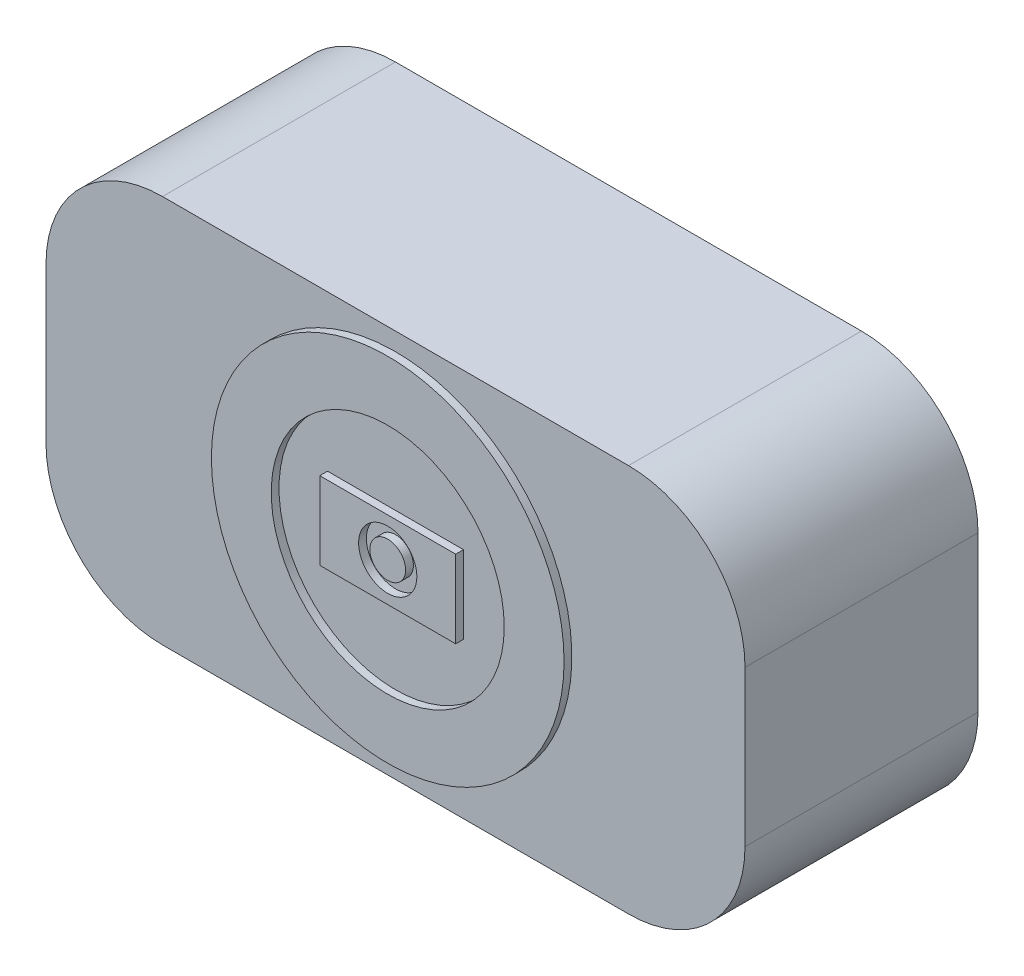
ISO-10303-21;
HEADER;
FILE_DESCRIPTION(('STEP AP214'),'2;1');
FILE_NAME('part.step','',(''),(''),'','','');
FILE_SCHEMA(('AUTOMOTIVE_DESIGN { 1 0 10303 214 1 1 1 1 }'));
ENDSEC;
DATA;
#1=APPLICATION_CONTEXT('core data for automotive mechanical design processes');
#2=APPLICATION_PROTOCOL_DEFINITION('international standard','automotive_design',2000,#1);
#3=PRODUCT_CONTEXT('',#1,'mechanical');
#4=PRODUCT('Part','Part','',(#3));
#5=PRODUCT_RELATED_PRODUCT_CATEGORY('part','',(#4));
#6=PRODUCT_DEFINITION_FORMATION('','',#4);
#7=PRODUCT_DEFINITION_CONTEXT('part definition',#1,'design');
#8=PRODUCT_DEFINITION('design','',#6,#7);
#9=PRODUCT_DEFINITION_SHAPE('','',#8);
#10=(LENGTH_UNIT() NAMED_UNIT(*) SI_UNIT(.MILLI.,.METRE.));
#11=(NAMED_UNIT(*) PLANE_ANGLE_UNIT() SI_UNIT($,.RADIAN.));
#12=(NAMED_UNIT(*) SI_UNIT($,.STERADIAN.) SOLID_ANGLE_UNIT());
#13=UNCERTAINTY_MEASURE_WITH_UNIT(LENGTH_MEASURE(1.E-05),#10,'distance_accuracy_value','');
#14=(GEOMETRIC_REPRESENTATION_CONTEXT(3) GLOBAL_UNCERTAINTY_ASSIGNED_CONTEXT((#13)) GLOBAL_UNIT_ASSIGNED_CONTEXT((#10,
#11,#12)) REPRESENTATION_CONTEXT('',''));
#15=CARTESIAN_POINT('',(0.,0.,0.));
#16=DIRECTION('',(0.,0.,1.));
#17=DIRECTION('',(1.,0.,0.));
#18=AXIS2_PLACEMENT_3D('',#15,#16,#17);
#19=CARTESIAN_POINT('',(45.,25.,0.));
#20=DIRECTION('',(0.,0.,1.));
#21=DIRECTION('',(1.,0.,0.));
#22=AXIS2_PLACEMENT_3D('',#19,#20,#21);
#23=PLANE('',#22);
#24=CARTESIAN_POINT('',(45.,25.,0.));
#25=DIRECTION('',(0.,0.,1.));
#26=DIRECTION('',(1.,0.,0.));
#27=AXIS2_PLACEMENT_3D('',#24,#25,#26);
#28=CIRCLE('',#27,3.75000000000001);
#29=CARTESIAN_POINT('',(48.75,25.,0.));
#30=VERTEX_POINT('',#29);
#31=EDGE_CURVE('E433',#30,#30,#28,.T.);
#32=ORIENTED_EDGE('',*,*,#31,.T.);
#33=EDGE_LOOP('',(#32));
#34=FACE_BOUND('',#33,.T.);
#35=CARTESIAN_POINT('',(45.,25.,0.));
#36=DIRECTION('',(0.,0.,1.));
#37=DIRECTION('',(1.,0.,0.));
#38=AXIS2_PLACEMENT_3D('',#35,#36,#37);
#39=CIRCLE('',#38,2.30333071039238);
#40=CARTESIAN_POINT('',(47.3033307103924,25.,0.));
#41=VERTEX_POINT('',#40);
#42=EDGE_CURVE('E430',#41,#41,#39,.T.);
#43=ORIENTED_EDGE('',*,*,#42,.F.);
#44=EDGE_LOOP('',(#43));
#45=FACE_BOUND('',#44,.T.);
#46=ADVANCED_FACE('F33',(#34,#45),#23,.T.);
#47=CARTESIAN_POINT('',(45.,25.,0.));
#48=DIRECTION('',(0.,0.,1.));
#49=DIRECTION('',(1.,0.,0.));
#50=AXIS2_PLACEMENT_3D('',#47,#48,#49);
#51=PLANE('',#50);
#52=CARTESIAN_POINT('',(45.,25.,0.));
#53=DIRECTION('',(0.,0.,1.));
#54=DIRECTION('',(1.,0.,0.));
#55=AXIS2_PLACEMENT_3D('',#52,#53,#54);
#56=CIRCLE('',#55,15.);
#57=CARTESIAN_POINT('',(60.,25.,0.));
#58=VERTEX_POINT('',#57);
#59=EDGE_CURVE('E152',#58,#58,#56,.T.);
#60=ORIENTED_EDGE('',*,*,#59,.T.);
#61=EDGE_LOOP('',(#60));
#62=FACE_BOUND('',#61,.T.);
#63=DIRECTION('',(1.,0.,0.));
#64=VECTOR('',#63,1.);
#65=CARTESIAN_POINT('',(36.25,20.,0.));
#66=LINE('',#65,#64);
#67=CARTESIAN_POINT('',(36.25,20.,0.));
#68=VERTEX_POINT('',#67);
#69=CARTESIAN_POINT('',(53.75,20.,0.));
#70=VERTEX_POINT('',#69);
#71=EDGE_CURVE('E443',#68,#70,#66,.T.);
#72=ORIENTED_EDGE('',*,*,#71,.F.);
#73=DIRECTION('',(0.,-1.,0.));
#74=VECTOR('',#73,1.);
#75=CARTESIAN_POINT('',(36.25,20.,0.));
#76=LINE('',#75,#74);
#77=CARTESIAN_POINT('',(36.25,30.,0.));
#78=VERTEX_POINT('',#77);
#79=EDGE_CURVE('E147',#78,#68,#76,.T.);
#80=ORIENTED_EDGE('',*,*,#79,.F.);
#81=DIRECTION('',(-1.,0.,0.));
#82=VECTOR('',#81,1.);
#83=CARTESIAN_POINT('',(36.25,30.,0.));
#84=LINE('',#83,#82);
#85=CARTESIAN_POINT('',(53.75,30.,0.));
#86=VERTEX_POINT('',#85);
#87=EDGE_CURVE('E143',#86,#78,#84,.T.);
#88=ORIENTED_EDGE('',*,*,#87,.F.);
#89=DIRECTION('',(0.,1.,0.));
#90=VECTOR('',#89,1.);
#91=CARTESIAN_POINT('',(53.75,20.,0.));
#92=LINE('',#91,#90);
#93=EDGE_CURVE('E445',#70,#86,#92,.T.);
#94=ORIENTED_EDGE('',*,*,#93,.F.);
#95=EDGE_LOOP('',(#72,#80,#88,#94));
#96=FACE_BOUND('',#95,.T.);
#97=ADVANCED_FACE('F261',(#62,#96),#51,.T.);
#98=CARTESIAN_POINT('',(0.,0.,0.));
#99=DIRECTION('',(0.,0.,-1.));
#100=DIRECTION('',(-1.,0.,0.));
#101=AXIS2_PLACEMENT_3D('',#98,#99,#100);
#102=PLANE('',#101);
#103=DIRECTION('',(1.,0.,0.));
#104=VECTOR('',#103,1.);
#105=CARTESIAN_POINT('',(0.,0.,0.));
#106=LINE('',#105,#104);
#107=CARTESIAN_POINT('',(15.,0.,0.));
#108=VERTEX_POINT('',#107);
#109=CARTESIAN_POINT('',(75.,0.,0.));
#110=VERTEX_POINT('',#109);
#111=EDGE_CURVE('E178',#108,#110,#106,.T.);
#112=ORIENTED_EDGE('',*,*,#111,.T.);
#113=CARTESIAN_POINT('',(75.,15.,0.));
#114=DIRECTION('',(0.,0.,-1.));
#115=DIRECTION('',(-1.,0.,0.));
#116=AXIS2_PLACEMENT_3D('',#113,#114,#115);
#117=CIRCLE('',#116,15.);
#118=CARTESIAN_POINT('',(90.,15.,0.));
#119=VERTEX_POINT('',#118);
#120=EDGE_CURVE('E196',#110,#119,#117,.F.);
#121=ORIENTED_EDGE('',*,*,#120,.T.);
#122=DIRECTION('',(0.,1.,0.));
#123=VECTOR('',#122,1.);
#124=CARTESIAN_POINT('',(90.,0.,0.));
#125=LINE('',#124,#123);
#126=CARTESIAN_POINT('',(90.,35.,0.));
#127=VERTEX_POINT('',#126);
#128=EDGE_CURVE('E181',#119,#127,#125,.T.);
#129=ORIENTED_EDGE('',*,*,#128,.T.);
#130=CARTESIAN_POINT('',(75.,35.,0.));
#131=DIRECTION('',(0.,0.,-1.));
#132=DIRECTION('',(-1.,0.,0.));
#133=AXIS2_PLACEMENT_3D('',#130,#131,#132);
#134=CIRCLE('',#133,15.);
#135=CARTESIAN_POINT('',(75.,50.,0.));
#136=VERTEX_POINT('',#135);
#137=EDGE_CURVE('E190',#127,#136,#134,.F.);
#138=ORIENTED_EDGE('',*,*,#137,.T.);
#139=DIRECTION('',(-1.,0.,0.));
#140=VECTOR('',#139,1.);
#141=CARTESIAN_POINT('',(0.,50.,0.));
#142=LINE('',#141,#140);
#143=CARTESIAN_POINT('',(15.,50.,0.));
#144=VERTEX_POINT('',#143);
#145=EDGE_CURVE('E167',#136,#144,#142,.T.);
#146=ORIENTED_EDGE('',*,*,#145,.T.);
#147=CARTESIAN_POINT('',(15.,35.,0.));
#148=DIRECTION('',(0.,0.,-1.));
#149=DIRECTION('',(-1.,0.,0.));
#150=AXIS2_PLACEMENT_3D('',#147,#148,#149);
#151=CIRCLE('',#150,15.);
#152=CARTESIAN_POINT('',(0.,35.,0.));
#153=VERTEX_POINT('',#152);
#154=EDGE_CURVE('E192',#144,#153,#151,.F.);
#155=ORIENTED_EDGE('',*,*,#154,.T.);
#156=DIRECTION('',(0.,-1.,0.));
#157=VECTOR('',#156,1.);
#158=CARTESIAN_POINT('',(0.,0.,0.));
#159=LINE('',#158,#157);
#160=CARTESIAN_POINT('',(0.,15.,0.));
#161=VERTEX_POINT('',#160);
#162=EDGE_CURVE('E162',#153,#161,#159,.T.);
#163=ORIENTED_EDGE('',*,*,#162,.T.);
#164=CARTESIAN_POINT('',(15.,15.,0.));
#165=DIRECTION('',(0.,0.,-1.));
#166=DIRECTION('',(-1.,0.,0.));
#167=AXIS2_PLACEMENT_3D('',#164,#165,#166);
#168=CIRCLE('',#167,15.);
#169=EDGE_CURVE('E194',#161,#108,#168,.F.);
#170=ORIENTED_EDGE('',*,*,#169,.T.);
#171=EDGE_LOOP('',(#112,#121,#129,#138,#146,#155,#163,#170));
#172=FACE_BOUND('',#171,.T.);
#173=CARTESIAN_POINT('',(45.,25.,0.));
#174=DIRECTION('',(0.,0.,-1.));
#175=DIRECTION('',(-1.,0.,0.));
#176=AXIS2_PLACEMENT_3D('',#173,#174,#175);
#177=CIRCLE('',#176,22.703438641427);
#178=CARTESIAN_POINT('',(22.296561358573,25.,0.));
#179=VERTEX_POINT('',#178);
#180=EDGE_CURVE('E11',#179,#179,#177,.F.);
#181=ORIENTED_EDGE('',*,*,#180,.F.);
#182=EDGE_LOOP('',(#181));
#183=FACE_BOUND('',#182,.T.);
#184=ADVANCED_FACE('F224',(#172,#183),#102,.F.);
#185=CARTESIAN_POINT('',(0.,0.,-30.));
#186=DIRECTION('',(-1.,0.,0.));
#187=DIRECTION('',(0.,0.,1.));
#188=AXIS2_PLACEMENT_3D('',#185,#186,#187);
#189=PLANE('',#188);
#190=DIRECTION('',(0.,-1.,0.));
#191=VECTOR('',#190,1.);
#192=CARTESIAN_POINT('',(0.,0.,-30.));
#193=LINE('',#192,#191);
#194=CARTESIAN_POINT('',(0.,35.,-30.));
#195=VERTEX_POINT('',#194);
#196=CARTESIAN_POINT('',(0.,15.,-30.));
#197=VERTEX_POINT('',#196);
#198=EDGE_CURVE('E163',#195,#197,#193,.T.);
#199=ORIENTED_EDGE('',*,*,#198,.T.);
#200=DIRECTION('',(0.,0.,1.));
#201=VECTOR('',#200,1.);
#202=CARTESIAN_POINT('',(0.,15.,-30.));
#203=LINE('',#202,#201);
#204=EDGE_CURVE('E212',#197,#161,#203,.T.);
#205=ORIENTED_EDGE('',*,*,#204,.T.);
#206=ORIENTED_EDGE('',*,*,#162,.F.);
#207=DIRECTION('',(0.,0.,1.));
#208=VECTOR('',#207,1.);
#209=CARTESIAN_POINT('',(0.,35.,-30.));
#210=LINE('',#209,#208);
#211=EDGE_CURVE('E210',#153,#195,#210,.F.);
#212=ORIENTED_EDGE('',*,*,#211,.T.);
#213=EDGE_LOOP('',(#199,#205,#206,#212));
#214=FACE_BOUND('',#213,.T.);
#215=ADVANCED_FACE('F250',(#214),#189,.T.);
#216=CARTESIAN_POINT('',(0.,50.,-30.));
#217=DIRECTION('',(0.,1.,0.));
#218=DIRECTION('',(0.,0.,1.));
#219=AXIS2_PLACEMENT_3D('',#216,#217,#218);
#220=PLANE('',#219);
#221=DIRECTION('',(-1.,0.,0.));
#222=VECTOR('',#221,1.);
#223=CARTESIAN_POINT('',(0.,50.,-30.));
#224=LINE('',#223,#222);
#225=CARTESIAN_POINT('',(75.,50.,-30.));
#226=VERTEX_POINT('',#225);
#227=CARTESIAN_POINT('',(15.,50.,-30.));
#228=VERTEX_POINT('',#227);
#229=EDGE_CURVE('E173',#226,#228,#224,.T.);
#230=ORIENTED_EDGE('',*,*,#229,.T.);
#231=DIRECTION('',(0.,0.,1.));
#232=VECTOR('',#231,1.);
#233=CARTESIAN_POINT('',(15.,50.,-30.));
#234=LINE('',#233,#232);
#235=EDGE_CURVE('E41',#228,#144,#234,.T.);
#236=ORIENTED_EDGE('',*,*,#235,.T.);
#237=ORIENTED_EDGE('',*,*,#145,.F.);
#238=DIRECTION('',(0.,0.,1.));
#239=VECTOR('',#238,1.);
#240=CARTESIAN_POINT('',(75.,50.,-30.));
#241=LINE('',#240,#239);
#242=EDGE_CURVE('E215',#136,#226,#241,.F.);
#243=ORIENTED_EDGE('',*,*,#242,.T.);
#244=EDGE_LOOP('',(#230,#236,#237,#243));
#245=FACE_BOUND('',#244,.T.);
#246=ADVANCED_FACE('F220',(#245),#220,.T.);
#247=CARTESIAN_POINT('',(90.,0.,-30.));
#248=DIRECTION('',(1.,0.,0.));
#249=DIRECTION('',(0.,0.,-1.));
#250=AXIS2_PLACEMENT_3D('',#247,#248,#249);
#251=PLANE('',#250);
#252=ORIENTED_EDGE('',*,*,#128,.F.);
#253=DIRECTION('',(0.,0.,1.));
#254=VECTOR('',#253,1.);
#255=CARTESIAN_POINT('',(90.,15.,-30.));
#256=LINE('',#255,#254);
#257=CARTESIAN_POINT('',(90.,15.,-30.));
#258=VERTEX_POINT('',#257);
#259=EDGE_CURVE('E201',#119,#258,#256,.F.);
#260=ORIENTED_EDGE('',*,*,#259,.T.);
#261=DIRECTION('',(0.,1.,0.));
#262=VECTOR('',#261,1.);
#263=CARTESIAN_POINT('',(90.,0.,-30.));
#264=LINE('',#263,#262);
#265=CARTESIAN_POINT('',(90.,35.,-30.));
#266=VERTEX_POINT('',#265);
#267=EDGE_CURVE('E170',#258,#266,#264,.T.);
#268=ORIENTED_EDGE('',*,*,#267,.T.);
#269=DIRECTION('',(0.,0.,1.));
#270=VECTOR('',#269,1.);
#271=CARTESIAN_POINT('',(90.,35.,-30.));
#272=LINE('',#271,#270);
#273=EDGE_CURVE('E198',#266,#127,#272,.T.);
#274=ORIENTED_EDGE('',*,*,#273,.T.);
#275=EDGE_LOOP('',(#252,#260,#268,#274));
#276=FACE_BOUND('',#275,.T.);
#277=ADVANCED_FACE('F232',(#276),#251,.T.);
#278=CARTESIAN_POINT('',(0.,0.,-30.));
#279=DIRECTION('',(0.,-1.,0.));
#280=DIRECTION('',(0.,0.,-1.));
#281=AXIS2_PLACEMENT_3D('',#278,#279,#280);
#282=PLANE('',#281);
#283=DIRECTION('',(1.,0.,0.));
#284=VECTOR('',#283,1.);
#285=CARTESIAN_POINT('',(0.,0.,-30.));
#286=LINE('',#285,#284);
#287=CARTESIAN_POINT('',(15.,0.,-30.));
#288=VERTEX_POINT('',#287);
#289=CARTESIAN_POINT('',(75.,0.,-30.));
#290=VERTEX_POINT('',#289);
#291=EDGE_CURVE('E166',#288,#290,#286,.T.);
#292=ORIENTED_EDGE('',*,*,#291,.T.);
#293=DIRECTION('',(0.,0.,1.));
#294=VECTOR('',#293,1.);
#295=CARTESIAN_POINT('',(75.,0.,-30.));
#296=LINE('',#295,#294);
#297=EDGE_CURVE('E187',#290,#110,#296,.T.);
#298=ORIENTED_EDGE('',*,*,#297,.T.);
#299=ORIENTED_EDGE('',*,*,#111,.F.);
#300=DIRECTION('',(0.,0.,1.));
#301=VECTOR('',#300,1.);
#302=CARTESIAN_POINT('',(15.,0.,-30.));
#303=LINE('',#302,#301);
#304=EDGE_CURVE('E175',#108,#288,#303,.F.);
#305=ORIENTED_EDGE('',*,*,#304,.T.);
#306=EDGE_LOOP('',(#292,#298,#299,#305));
#307=FACE_BOUND('',#306,.T.);
#308=ADVANCED_FACE('F243',(#307),#282,.T.);
#309=CARTESIAN_POINT('',(0.,0.,-30.));
#310=DIRECTION('',(0.,0.,-1.));
#311=DIRECTION('',(-1.,0.,0.));
#312=AXIS2_PLACEMENT_3D('',#309,#310,#311);
#313=PLANE('',#312);
#314=ORIENTED_EDGE('',*,*,#267,.F.);
#315=CARTESIAN_POINT('',(75.,15.,-30.));
#316=DIRECTION('',(0.,0.,-1.));
#317=DIRECTION('',(-1.,0.,0.));
#318=AXIS2_PLACEMENT_3D('',#315,#316,#317);
#319=CIRCLE('',#318,15.);
#320=EDGE_CURVE('E208',#258,#290,#319,.T.);
#321=ORIENTED_EDGE('',*,*,#320,.T.);
#322=ORIENTED_EDGE('',*,*,#291,.F.);
#323=CARTESIAN_POINT('',(15.,15.,-30.));
#324=DIRECTION('',(0.,0.,-1.));
#325=DIRECTION('',(-1.,0.,0.));
#326=AXIS2_PLACEMENT_3D('',#323,#324,#325);
#327=CIRCLE('',#326,15.);
#328=EDGE_CURVE('E206',#288,#197,#327,.T.);
#329=ORIENTED_EDGE('',*,*,#328,.T.);
#330=ORIENTED_EDGE('',*,*,#198,.F.);
#331=CARTESIAN_POINT('',(15.,35.,-30.));
#332=DIRECTION('',(0.,0.,-1.));
#333=DIRECTION('',(-1.,0.,0.));
#334=AXIS2_PLACEMENT_3D('',#331,#332,#333);
#335=CIRCLE('',#334,15.);
#336=EDGE_CURVE('E56',#195,#228,#335,.T.);
#337=ORIENTED_EDGE('',*,*,#336,.T.);
#338=ORIENTED_EDGE('',*,*,#229,.F.);
#339=CARTESIAN_POINT('',(75.,35.,-30.));
#340=DIRECTION('',(0.,0.,-1.));
#341=DIRECTION('',(-1.,0.,0.));
#342=AXIS2_PLACEMENT_3D('',#339,#340,#341);
#343=CIRCLE('',#342,15.);
#344=EDGE_CURVE('E203',#226,#266,#343,.T.);
#345=ORIENTED_EDGE('',*,*,#344,.T.);
#346=EDGE_LOOP('',(#314,#321,#322,#329,#330,#337,#338,#345));
#347=FACE_BOUND('',#346,.T.);
#348=ADVANCED_FACE('F236',(#347),#313,.T.);
#349=CARTESIAN_POINT('',(75.,15.,-30.));
#350=DIRECTION('',(0.,0.,1.));
#351=DIRECTION('',(1.,0.,0.));
#352=AXIS2_PLACEMENT_3D('',#349,#350,#351);
#353=CYLINDRICAL_SURFACE('',#352,15.);
#354=ORIENTED_EDGE('',*,*,#320,.F.);
#355=ORIENTED_EDGE('',*,*,#259,.F.);
#356=ORIENTED_EDGE('',*,*,#120,.F.);
#357=ORIENTED_EDGE('',*,*,#297,.F.);
#358=EDGE_LOOP('',(#354,#355,#356,#357));
#359=FACE_BOUND('',#358,.T.);
#360=ADVANCED_FACE('F240',(#359),#353,.T.);
#361=CARTESIAN_POINT('',(15.,15.,-30.));
#362=DIRECTION('',(0.,0.,1.));
#363=DIRECTION('',(1.,0.,0.));
#364=AXIS2_PLACEMENT_3D('',#361,#362,#363);
#365=CYLINDRICAL_SURFACE('',#364,15.);
#366=ORIENTED_EDGE('',*,*,#328,.F.);
#367=ORIENTED_EDGE('',*,*,#304,.F.);
#368=ORIENTED_EDGE('',*,*,#169,.F.);
#369=ORIENTED_EDGE('',*,*,#204,.F.);
#370=EDGE_LOOP('',(#366,#367,#368,#369));
#371=FACE_BOUND('',#370,.T.);
#372=ADVANCED_FACE('F248',(#371),#365,.T.);
#373=CARTESIAN_POINT('',(15.,35.,-30.));
#374=DIRECTION('',(0.,0.,1.));
#375=DIRECTION('',(1.,0.,0.));
#376=AXIS2_PLACEMENT_3D('',#373,#374,#375);
#377=CYLINDRICAL_SURFACE('',#376,15.);
#378=ORIENTED_EDGE('',*,*,#336,.F.);
#379=ORIENTED_EDGE('',*,*,#211,.F.);
#380=ORIENTED_EDGE('',*,*,#154,.F.);
#381=ORIENTED_EDGE('',*,*,#235,.F.);
#382=EDGE_LOOP('',(#378,#379,#380,#381));
#383=FACE_BOUND('',#382,.T.);
#384=ADVANCED_FACE('F252',(#383),#377,.T.);
#385=CARTESIAN_POINT('',(75.,35.,-30.));
#386=DIRECTION('',(0.,0.,1.));
#387=DIRECTION('',(1.,0.,0.));
#388=AXIS2_PLACEMENT_3D('',#385,#386,#387);
#389=CYLINDRICAL_SURFACE('',#388,15.);
#390=ORIENTED_EDGE('',*,*,#344,.F.);
#391=ORIENTED_EDGE('',*,*,#242,.F.);
#392=ORIENTED_EDGE('',*,*,#137,.F.);
#393=ORIENTED_EDGE('',*,*,#273,.F.);
#394=EDGE_LOOP('',(#390,#391,#392,#393));
#395=FACE_BOUND('',#394,.T.);
#396=ADVANCED_FACE('F35',(#395),#389,.T.);
#397=CARTESIAN_POINT('',(45.,25.,1.));
#398=DIRECTION('',(0.,0.,-1.));
#399=DIRECTION('',(-1.,0.,0.));
#400=AXIS2_PLACEMENT_3D('',#397,#398,#399);
#401=CYLINDRICAL_SURFACE('',#400,22.703438641427);
#402=CARTESIAN_POINT('',(45.,25.,1.));
#403=DIRECTION('',(0.,0.,1.));
#404=DIRECTION('',(1.,0.,0.));
#405=AXIS2_PLACEMENT_3D('',#402,#403,#404);
#406=CIRCLE('',#405,22.703438641427);
#407=CARTESIAN_POINT('',(67.7034386414269,25.,1.));
#408=VERTEX_POINT('',#407);
#409=EDGE_CURVE('E158',#408,#408,#406,.T.);
#410=ORIENTED_EDGE('',*,*,#409,.F.);
#411=EDGE_LOOP('',(#410));
#412=FACE_BOUND('',#411,.T.);
#413=ORIENTED_EDGE('',*,*,#180,.T.);
#414=EDGE_LOOP('',(#413));
#415=FACE_BOUND('',#414,.T.);
#416=ADVANCED_FACE('F258',(#412,#415),#401,.T.);
#417=CARTESIAN_POINT('',(45.,25.,1.));
#418=DIRECTION('',(0.,0.,1.));
#419=DIRECTION('',(1.,0.,0.));
#420=AXIS2_PLACEMENT_3D('',#417,#418,#419);
#421=PLANE('',#420);
#422=CARTESIAN_POINT('',(45.,25.,1.));
#423=DIRECTION('',(0.,0.,1.));
#424=DIRECTION('',(1.,0.,0.));
#425=AXIS2_PLACEMENT_3D('',#422,#423,#424);
#426=CIRCLE('',#425,15.);
#427=CARTESIAN_POINT('',(60.,25.,1.));
#428=VERTEX_POINT('',#427);
#429=EDGE_CURVE('E149',#428,#428,#426,.T.);
#430=ORIENTED_EDGE('',*,*,#429,.F.);
#431=EDGE_LOOP('',(#430));
#432=FACE_BOUND('',#431,.T.);
#433=ORIENTED_EDGE('',*,*,#409,.T.);
#434=EDGE_LOOP('',(#433));
#435=FACE_BOUND('',#434,.T.);
#436=ADVANCED_FACE('F296',(#432,#435),#421,.T.);
#437=CARTESIAN_POINT('',(45.,25.,0.));
#438=DIRECTION('',(0.,0.,1.));
#439=DIRECTION('',(1.,0.,0.));
#440=AXIS2_PLACEMENT_3D('',#437,#438,#439);
#441=CYLINDRICAL_SURFACE('',#440,15.);
#442=ORIENTED_EDGE('',*,*,#59,.F.);
#443=EDGE_LOOP('',(#442));
#444=FACE_BOUND('',#443,.T.);
#445=ORIENTED_EDGE('',*,*,#429,.T.);
#446=EDGE_LOOP('',(#445));
#447=FACE_BOUND('',#446,.T.);
#448=ADVANCED_FACE('F292',(#444,#447),#441,.F.);
#449=CARTESIAN_POINT('',(36.25,20.,1.));
#450=DIRECTION('',(1.,0.,0.));
#451=DIRECTION('',(0.,0.,-1.));
#452=AXIS2_PLACEMENT_3D('',#449,#450,#451);
#453=PLANE('',#452);
#454=ORIENTED_EDGE('',*,*,#79,.T.);
#455=DIRECTION('',(0.,0.,-1.));
#456=VECTOR('',#455,1.);
#457=CARTESIAN_POINT('',(36.25,20.,1.));
#458=LINE('',#457,#456);
#459=CARTESIAN_POINT('',(36.25,20.,1.));
#460=VERTEX_POINT('',#459);
#461=EDGE_CURVE('E128',#460,#68,#458,.T.);
#462=ORIENTED_EDGE('',*,*,#461,.F.);
#463=DIRECTION('',(0.,-1.,0.));
#464=VECTOR('',#463,1.);
#465=CARTESIAN_POINT('',(36.25,20.,1.));
#466=LINE('',#465,#464);
#467=CARTESIAN_POINT('',(36.25,30.,1.));
#468=VERTEX_POINT('',#467);
#469=EDGE_CURVE('E135',#468,#460,#466,.T.);
#470=ORIENTED_EDGE('',*,*,#469,.F.);
#471=DIRECTION('',(0.,0.,-1.));
#472=VECTOR('',#471,1.);
#473=CARTESIAN_POINT('',(36.25,30.,1.));
#474=LINE('',#473,#472);
#475=EDGE_CURVE('E441',#468,#78,#474,.T.);
#476=ORIENTED_EDGE('',*,*,#475,.T.);
#477=EDGE_LOOP('',(#454,#462,#470,#476));
#478=FACE_BOUND('',#477,.T.);
#479=ADVANCED_FACE('F145',(#478),#453,.F.);
#480=CARTESIAN_POINT('',(36.25,20.,1.));
#481=DIRECTION('',(0.,1.,0.));
#482=DIRECTION('',(0.,0.,1.));
#483=AXIS2_PLACEMENT_3D('',#480,#481,#482);
#484=PLANE('',#483);
#485=ORIENTED_EDGE('',*,*,#71,.T.);
#486=DIRECTION('',(0.,0.,-1.));
#487=VECTOR('',#486,1.);
#488=CARTESIAN_POINT('',(53.75,20.,1.));
#489=LINE('',#488,#487);
#490=CARTESIAN_POINT('',(53.75,20.,1.));
#491=VERTEX_POINT('',#490);
#492=EDGE_CURVE('E131',#491,#70,#489,.T.);
#493=ORIENTED_EDGE('',*,*,#492,.F.);
#494=DIRECTION('',(1.,0.,0.));
#495=VECTOR('',#494,1.);
#496=CARTESIAN_POINT('',(36.25,20.,1.));
#497=LINE('',#496,#495);
#498=EDGE_CURVE('E124',#460,#491,#497,.T.);
#499=ORIENTED_EDGE('',*,*,#498,.F.);
#500=ORIENTED_EDGE('',*,*,#461,.T.);
#501=EDGE_LOOP('',(#485,#493,#499,#500));
#502=FACE_BOUND('',#501,.T.);
#503=ADVANCED_FACE('F126',(#502),#484,.F.);
#504=CARTESIAN_POINT('',(53.75,20.,1.));
#505=DIRECTION('',(-1.,0.,0.));
#506=DIRECTION('',(0.,0.,1.));
#507=AXIS2_PLACEMENT_3D('',#504,#505,#506);
#508=PLANE('',#507);
#509=ORIENTED_EDGE('',*,*,#93,.T.);
#510=DIRECTION('',(0.,0.,-1.));
#511=VECTOR('',#510,1.);
#512=CARTESIAN_POINT('',(53.75,30.,1.));
#513=LINE('',#512,#511);
#514=CARTESIAN_POINT('',(53.75,30.,1.));
#515=VERTEX_POINT('',#514);
#516=EDGE_CURVE('E48',#515,#86,#513,.T.);
#517=ORIENTED_EDGE('',*,*,#516,.F.);
#518=DIRECTION('',(0.,1.,0.));
#519=VECTOR('',#518,1.);
#520=CARTESIAN_POINT('',(53.75,20.,1.));
#521=LINE('',#520,#519);
#522=EDGE_CURVE('E134',#491,#515,#521,.T.);
#523=ORIENTED_EDGE('',*,*,#522,.F.);
#524=ORIENTED_EDGE('',*,*,#492,.T.);
#525=EDGE_LOOP('',(#509,#517,#523,#524));
#526=FACE_BOUND('',#525,.T.);
#527=ADVANCED_FACE('F285',(#526),#508,.F.);
#528=CARTESIAN_POINT('',(36.25,30.,1.));
#529=DIRECTION('',(0.,-1.,0.));
#530=DIRECTION('',(1.,0.,0.));
#531=AXIS2_PLACEMENT_3D('',#528,#529,#530);
#532=PLANE('',#531);
#533=ORIENTED_EDGE('',*,*,#87,.T.);
#534=ORIENTED_EDGE('',*,*,#475,.F.);
#535=DIRECTION('',(-1.,0.,0.));
#536=VECTOR('',#535,1.);
#537=CARTESIAN_POINT('',(36.25,30.,1.));
#538=LINE('',#537,#536);
#539=EDGE_CURVE('E139',#515,#468,#538,.T.);
#540=ORIENTED_EDGE('',*,*,#539,.F.);
#541=ORIENTED_EDGE('',*,*,#516,.T.);
#542=EDGE_LOOP('',(#533,#534,#540,#541));
#543=FACE_BOUND('',#542,.T.);
#544=ADVANCED_FACE('F281',(#543),#532,.F.);
#545=CARTESIAN_POINT('',(0.,0.,1.));
#546=DIRECTION('',(0.,0.,-1.));
#547=DIRECTION('',(-1.,0.,0.));
#548=AXIS2_PLACEMENT_3D('',#545,#546,#547);
#549=PLANE('',#548);
#550=CARTESIAN_POINT('',(45.,25.,1.));
#551=DIRECTION('',(0.,0.,1.));
#552=DIRECTION('',(1.,0.,0.));
#553=AXIS2_PLACEMENT_3D('',#550,#551,#552);
#554=CIRCLE('',#553,3.75000000000001);
#555=CARTESIAN_POINT('',(48.75,25.,1.));
#556=VERTEX_POINT('',#555);
#557=EDGE_CURVE('E429',#556,#556,#554,.T.);
#558=ORIENTED_EDGE('',*,*,#557,.F.);
#559=EDGE_LOOP('',(#558));
#560=FACE_BOUND('',#559,.T.);
#561=ORIENTED_EDGE('',*,*,#469,.T.);
#562=ORIENTED_EDGE('',*,*,#498,.T.);
#563=ORIENTED_EDGE('',*,*,#522,.T.);
#564=ORIENTED_EDGE('',*,*,#539,.T.);
#565=EDGE_LOOP('',(#561,#562,#563,#564));
#566=FACE_BOUND('',#565,.T.);
#567=ADVANCED_FACE('F138',(#560,#566),#549,.F.);
#568=CARTESIAN_POINT('',(45.,25.,0.));
#569=DIRECTION('',(0.,0.,1.));
#570=DIRECTION('',(1.,0.,0.));
#571=AXIS2_PLACEMENT_3D('',#568,#569,#570);
#572=CYLINDRICAL_SURFACE('',#571,3.75000000000001);
#573=ORIENTED_EDGE('',*,*,#31,.F.);
#574=EDGE_LOOP('',(#573));
#575=FACE_BOUND('',#574,.T.);
#576=ORIENTED_EDGE('',*,*,#557,.T.);
#577=EDGE_LOOP('',(#576));
#578=FACE_BOUND('',#577,.T.);
#579=ADVANCED_FACE('F275',(#575,#578),#572,.F.);
#580=CARTESIAN_POINT('',(45.,25.,1.));
#581=DIRECTION('',(0.,0.,-1.));
#582=DIRECTION('',(-1.,0.,0.));
#583=AXIS2_PLACEMENT_3D('',#580,#581,#582);
#584=CYLINDRICAL_SURFACE('',#583,2.30333071039238);
#585=CARTESIAN_POINT('',(45.,25.,1.));
#586=DIRECTION('',(0.,0.,1.));
#587=DIRECTION('',(1.,0.,0.));
#588=AXIS2_PLACEMENT_3D('',#585,#586,#587);
#589=CIRCLE('',#588,2.30333071039238);
#590=CARTESIAN_POINT('',(47.3033307103924,25.,1.));
#591=VERTEX_POINT('',#590);
#592=EDGE_CURVE('E428',#591,#591,#589,.T.);
#593=ORIENTED_EDGE('',*,*,#592,.F.);
#594=EDGE_LOOP('',(#593));
#595=FACE_BOUND('',#594,.T.);
#596=ORIENTED_EDGE('',*,*,#42,.T.);
#597=EDGE_LOOP('',(#596));
#598=FACE_BOUND('',#597,.T.);
#599=ADVANCED_FACE('F273',(#595,#598),#584,.T.);
#600=CARTESIAN_POINT('',(45.,25.,1.));
#601=DIRECTION('',(0.,0.,1.));
#602=DIRECTION('',(1.,0.,0.));
#603=AXIS2_PLACEMENT_3D('',#600,#601,#602);
#604=PLANE('',#603);
#605=ORIENTED_EDGE('',*,*,#592,.T.);
#606=EDGE_LOOP('',(#605));
#607=FACE_BOUND('',#606,.T.);
#608=ADVANCED_FACE('F414',(#607),#604,.T.);
#609=CLOSED_SHELL('',(#46,#97,#184,#215,#246,#277,#308,#348,#360,#372,#384,#396,#416,#436,#448,
#479,#503,#527,#544,#567,#579,#599,#608));
#610=MANIFOLD_SOLID_BREP('B2',#609);
#611=ADVANCED_BREP_SHAPE_REPRESENTATION('',(#18,#610),#14);
#612=SHAPE_DEFINITION_REPRESENTATION(#9,#611);
ENDSEC;
END-ISO-10303-21;
